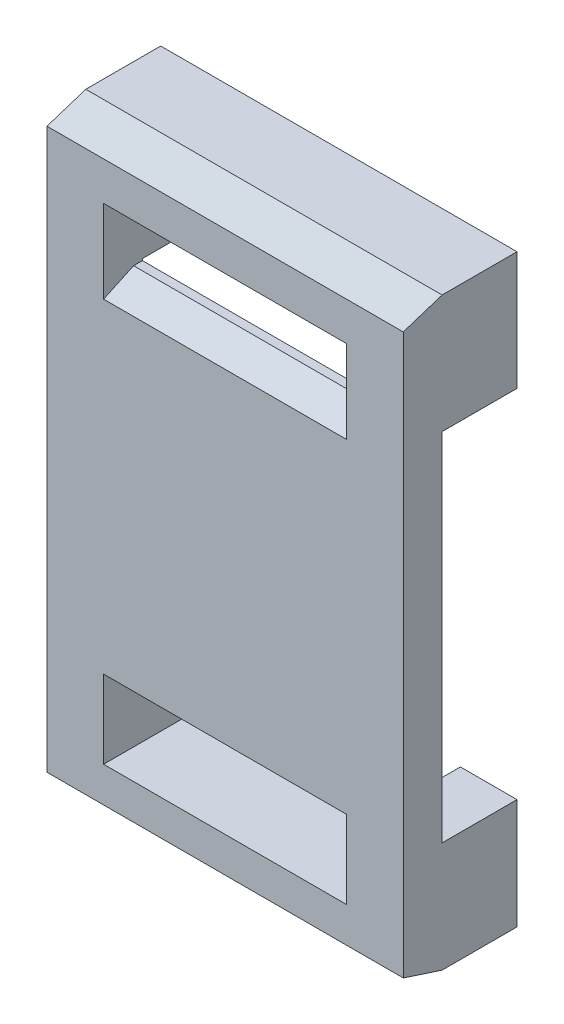
ISO-10303-21;
HEADER;
FILE_DESCRIPTION(('STEP AP214'),'2;1');
FILE_NAME('part.step','',(''),(''),'','','');
FILE_SCHEMA(('AUTOMOTIVE_DESIGN { 1 0 10303 214 1 1 1 1 }'));
ENDSEC;
DATA;
#1=APPLICATION_CONTEXT('core data for automotive mechanical design processes');
#2=APPLICATION_PROTOCOL_DEFINITION('international standard','automotive_design',2000,#1);
#3=PRODUCT_CONTEXT('',#1,'mechanical');
#4=PRODUCT('Part','Part','',(#3));
#5=PRODUCT_RELATED_PRODUCT_CATEGORY('part','',(#4));
#6=PRODUCT_DEFINITION_FORMATION('','',#4);
#7=PRODUCT_DEFINITION_CONTEXT('part definition',#1,'design');
#8=PRODUCT_DEFINITION('design','',#6,#7);
#9=PRODUCT_DEFINITION_SHAPE('','',#8);
#10=(LENGTH_UNIT() NAMED_UNIT(*) SI_UNIT(.MILLI.,.METRE.));
#11=(NAMED_UNIT(*) PLANE_ANGLE_UNIT() SI_UNIT($,.RADIAN.));
#12=(NAMED_UNIT(*) SI_UNIT($,.STERADIAN.) SOLID_ANGLE_UNIT());
#13=UNCERTAINTY_MEASURE_WITH_UNIT(LENGTH_MEASURE(1.E-05),#10,'distance_accuracy_value','');
#14=(GEOMETRIC_REPRESENTATION_CONTEXT(3) GLOBAL_UNCERTAINTY_ASSIGNED_CONTEXT((#13)) GLOBAL_UNIT_ASSIGNED_CONTEXT((#10,
#11,#12)) REPRESENTATION_CONTEXT('',''));
#15=CARTESIAN_POINT('',(0.,0.,0.));
#16=DIRECTION('',(0.,0.,1.));
#17=DIRECTION('',(1.,0.,0.));
#18=AXIS2_PLACEMENT_3D('',#15,#16,#17);
#19=CARTESIAN_POINT('',(43.8188937900036,2.78219181868884,152.2));
#20=DIRECTION('',(0.,0.,-1.));
#21=DIRECTION('',(-1.,0.,0.));
#22=AXIS2_PLACEMENT_3D('',#19,#20,#21);
#23=PLANE('',#22);
#24=DIRECTION('',(1.,0.,0.));
#25=VECTOR('',#24,1.);
#26=CARTESIAN_POINT('',(21.44814873,-17.3178089545572,152.2));
#27=LINE('',#26,#25);
#28=CARTESIAN_POINT('',(7.66270822982748,-17.3178089545572,152.2));
#29=VERTEX_POINT('',#28);
#30=CARTESIAN_POINT('',(21.44814873,-17.3178089545572,152.2));
#31=VERTEX_POINT('',#30);
#32=EDGE_CURVE('E304',#29,#31,#27,.T.);
#33=ORIENTED_EDGE('',*,*,#32,.F.);
#34=DIRECTION('',(0.,1.,0.));
#35=VECTOR('',#34,1.);
#36=CARTESIAN_POINT('',(7.66270822982748,2.78219181868884,152.2));
#37=LINE('',#36,#35);
#38=CARTESIAN_POINT('',(7.66270822982748,-17.4178089545572,152.2));
#39=VERTEX_POINT('',#38);
#40=EDGE_CURVE('E226',#29,#39,#37,.F.);
#41=ORIENTED_EDGE('',*,*,#40,.T.);
#42=DIRECTION('',(1.,0.,0.));
#43=VECTOR('',#42,1.);
#44=CARTESIAN_POINT('',(43.8188937900036,-17.4178089545572,152.2));
#45=LINE('',#44,#43);
#46=CARTESIAN_POINT('',(4.45072794,-17.4178089545573,152.2));
#47=VERTEX_POINT('',#46);
#48=EDGE_CURVE('E308',#47,#39,#45,.T.);
#49=ORIENTED_EDGE('',*,*,#48,.F.);
#50=DIRECTION('',(0.,1.,0.));
#51=VECTOR('',#50,1.);
#52=CARTESIAN_POINT('',(4.45072794,9.49392069,152.2));
#53=LINE('',#52,#51);
#54=CARTESIAN_POINT('',(4.45072794,2.78219181868884,152.2));
#55=VERTEX_POINT('',#54);
#56=EDGE_CURVE('E267',#47,#55,#53,.T.);
#57=ORIENTED_EDGE('',*,*,#56,.T.);
#58=DIRECTION('',(1.,0.,0.));
#59=VECTOR('',#58,1.);
#60=CARTESIAN_POINT('',(43.8188937900036,2.78219181868884,152.2));
#61=LINE('',#60,#59);
#62=CARTESIAN_POINT('',(7.66270822982748,2.78219181868884,152.2));
#63=VERTEX_POINT('',#62);
#64=EDGE_CURVE('E213',#63,#55,#61,.F.);
#65=ORIENTED_EDGE('',*,*,#64,.F.);
#66=DIRECTION('',(0.,1.,0.));
#67=VECTOR('',#66,1.);
#68=CARTESIAN_POINT('',(7.66270822982748,2.78219181868884,152.2));
#69=LINE('',#68,#67);
#70=CARTESIAN_POINT('',(7.66270822982748,2.68219181868884,152.2));
#71=VERTEX_POINT('',#70);
#72=EDGE_CURVE('E35',#63,#71,#69,.F.);
#73=ORIENTED_EDGE('',*,*,#72,.T.);
#74=DIRECTION('',(-1.,0.,0.));
#75=VECTOR('',#74,1.);
#76=CARTESIAN_POINT('',(7.66270822982748,2.68219181868884,152.2));
#77=LINE('',#76,#75);
#78=CARTESIAN_POINT('',(21.44814873,2.68219181868884,152.2));
#79=VERTEX_POINT('',#78);
#80=EDGE_CURVE('E205',#79,#71,#77,.T.);
#81=ORIENTED_EDGE('',*,*,#80,.F.);
#82=DIRECTION('',(0.,1.,0.));
#83=VECTOR('',#82,1.);
#84=CARTESIAN_POINT('',(21.44814873,2.78219181868884,152.2));
#85=LINE('',#84,#83);
#86=CARTESIAN_POINT('',(21.44814873,2.78219181868884,152.2));
#87=VERTEX_POINT('',#86);
#88=EDGE_CURVE('E215',#79,#87,#85,.T.);
#89=ORIENTED_EDGE('',*,*,#88,.T.);
#90=DIRECTION('',(1.,0.,0.));
#91=VECTOR('',#90,1.);
#92=CARTESIAN_POINT('',(43.8188937900036,2.78219181868884,152.2));
#93=LINE('',#92,#91);
#94=CARTESIAN_POINT('',(24.6601387687844,2.78219181868884,152.2));
#95=VERTEX_POINT('',#94);
#96=EDGE_CURVE('E206',#95,#87,#93,.F.);
#97=ORIENTED_EDGE('',*,*,#96,.F.);
#98=DIRECTION('',(0.,-1.,0.));
#99=VECTOR('',#98,1.);
#100=CARTESIAN_POINT('',(24.6601387687844,-23.66975969,152.2));
#101=LINE('',#100,#99);
#102=CARTESIAN_POINT('',(24.6601387687844,-17.4178089545572,152.2));
#103=VERTEX_POINT('',#102);
#104=EDGE_CURVE('E278',#95,#103,#101,.T.);
#105=ORIENTED_EDGE('',*,*,#104,.T.);
#106=DIRECTION('',(1.,0.,0.));
#107=VECTOR('',#106,1.);
#108=CARTESIAN_POINT('',(43.8188937900036,-17.4178089545572,152.2));
#109=LINE('',#108,#107);
#110=CARTESIAN_POINT('',(21.44814873,-17.4178089545572,152.2));
#111=VERTEX_POINT('',#110);
#112=EDGE_CURVE('E301',#111,#103,#109,.T.);
#113=ORIENTED_EDGE('',*,*,#112,.F.);
#114=DIRECTION('',(0.,1.,0.));
#115=VECTOR('',#114,1.);
#116=CARTESIAN_POINT('',(21.44814873,2.78219181868884,152.2));
#117=LINE('',#116,#115);
#118=EDGE_CURVE('E228',#111,#31,#117,.T.);
#119=ORIENTED_EDGE('',*,*,#118,.T.);
#120=EDGE_LOOP('',(#33,#41,#49,#57,#65,#73,#81,#89,#97,#105,#113,#119));
#121=FACE_BOUND('',#120,.T.);
#122=ADVANCED_FACE('F32',(#121),#23,.T.);
#123=CARTESIAN_POINT('',(24.6601387687844,9.49392069,154.4));
#124=DIRECTION('',(0.,-1.,0.));
#125=DIRECTION('',(1.,0.,0.));
#126=AXIS2_PLACEMENT_3D('',#123,#124,#125);
#127=PLANE('',#126);
#128=DIRECTION('',(0.,0.,1.));
#129=VECTOR('',#128,1.);
#130=CARTESIAN_POINT('',(24.6601387687844,9.49392069,154.4));
#131=LINE('',#130,#129);
#132=CARTESIAN_POINT('',(24.6601387687844,9.49392069,152.199999979562));
#133=VERTEX_POINT('',#132);
#134=CARTESIAN_POINT('',(24.6601387687844,9.49392069,147.95));
#135=VERTEX_POINT('',#134);
#136=EDGE_CURVE('E284',#133,#135,#131,.F.);
#137=ORIENTED_EDGE('',*,*,#136,.T.);
#138=DIRECTION('',(1.,0.,0.));
#139=VECTOR('',#138,1.);
#140=CARTESIAN_POINT('',(0.,9.49392069,147.95));
#141=LINE('',#140,#139);
#142=CARTESIAN_POINT('',(4.45072794,9.49392069,147.95));
#143=VERTEX_POINT('',#142);
#144=EDGE_CURVE('E313',#135,#143,#141,.F.);
#145=ORIENTED_EDGE('',*,*,#144,.T.);
#146=DIRECTION('',(0.,0.,-1.));
#147=VECTOR('',#146,1.);
#148=CARTESIAN_POINT('',(4.45072794,9.49392069,154.4));
#149=LINE('',#148,#147);
#150=CARTESIAN_POINT('',(4.45072794,9.49392069,152.199999979563));
#151=VERTEX_POINT('',#150);
#152=EDGE_CURVE('E260',#143,#151,#149,.F.);
#153=ORIENTED_EDGE('',*,*,#152,.T.);
#154=DIRECTION('',(1.,0.,0.));
#155=VECTOR('',#154,1.);
#156=CARTESIAN_POINT('',(43.8188937900036,9.49392069000003,152.199999979562));
#157=LINE('',#156,#155);
#158=EDGE_CURVE('E269',#133,#151,#157,.F.);
#159=ORIENTED_EDGE('',*,*,#158,.F.);
#160=EDGE_LOOP('',(#137,#145,#153,#159));
#161=FACE_BOUND('',#160,.T.);
#162=ADVANCED_FACE('F435',(#161),#127,.F.);
#163=CARTESIAN_POINT('',(4.45072794,-23.66975969,154.4));
#164=DIRECTION('',(0.,1.,0.));
#165=DIRECTION('',(0.,0.,1.));
#166=AXIS2_PLACEMENT_3D('',#163,#164,#165);
#167=PLANE('',#166);
#168=DIRECTION('',(1.,0.,0.));
#169=VECTOR('',#168,1.);
#170=CARTESIAN_POINT('',(43.8188937900036,-23.6697596899999,152.199999979563));
#171=LINE('',#170,#169);
#172=CARTESIAN_POINT('',(24.6601387687844,-23.66975969,152.199999979563));
#173=VERTEX_POINT('',#172);
#174=CARTESIAN_POINT('',(4.45072794,-23.6697596899999,152.199999979563));
#175=VERTEX_POINT('',#174);
#176=EDGE_CURVE('E293',#173,#175,#171,.F.);
#177=ORIENTED_EDGE('',*,*,#176,.T.);
#178=DIRECTION('',(0.,0.,-1.));
#179=VECTOR('',#178,1.);
#180=CARTESIAN_POINT('',(4.45072794,-23.66975969,154.4));
#181=LINE('',#180,#179);
#182=CARTESIAN_POINT('',(4.45072794,-23.66975969,147.95));
#183=VERTEX_POINT('',#182);
#184=EDGE_CURVE('E253',#175,#183,#181,.T.);
#185=ORIENTED_EDGE('',*,*,#184,.T.);
#186=DIRECTION('',(1.,0.,0.));
#187=VECTOR('',#186,1.);
#188=CARTESIAN_POINT('',(0.,-23.66975969,147.95));
#189=LINE('',#188,#187);
#190=CARTESIAN_POINT('',(24.6601387687844,-23.66975969,147.95));
#191=VERTEX_POINT('',#190);
#192=EDGE_CURVE('E297',#183,#191,#189,.T.);
#193=ORIENTED_EDGE('',*,*,#192,.T.);
#194=DIRECTION('',(0.,0.,1.));
#195=VECTOR('',#194,1.);
#196=CARTESIAN_POINT('',(24.6601387687844,-23.66975969,154.4));
#197=LINE('',#196,#195);
#198=EDGE_CURVE('E288',#191,#173,#197,.T.);
#199=ORIENTED_EDGE('',*,*,#198,.T.);
#200=EDGE_LOOP('',(#177,#185,#193,#199));
#201=FACE_BOUND('',#200,.T.);
#202=ADVANCED_FACE('F449',(#201),#167,.F.);
#203=CARTESIAN_POINT('',(43.8188937900036,2.78219181868884,120.8));
#204=DIRECTION('',(0.,-1.,0.));
#205=DIRECTION('',(0.,0.,-1.));
#206=AXIS2_PLACEMENT_3D('',#203,#204,#205);
#207=PLANE('',#206);
#208=ORIENTED_EDGE('',*,*,#96,.T.);
#209=DIRECTION('',(0.,0.,1.));
#210=VECTOR('',#209,1.);
#211=CARTESIAN_POINT('',(21.44814873,2.78219181868884,154.4));
#212=LINE('',#211,#210);
#213=CARTESIAN_POINT('',(21.44814873,2.78219181868884,147.95));
#214=VERTEX_POINT('',#213);
#215=EDGE_CURVE('E234',#214,#87,#212,.T.);
#216=ORIENTED_EDGE('',*,*,#215,.F.);
#217=DIRECTION('',(1.,0.,0.));
#218=VECTOR('',#217,1.);
#219=CARTESIAN_POINT('',(0.,2.78219181868884,147.95));
#220=LINE('',#219,#218);
#221=CARTESIAN_POINT('',(24.6601387687844,2.78219181868884,147.95));
#222=VERTEX_POINT('',#221);
#223=EDGE_CURVE('E220',#214,#222,#220,.T.);
#224=ORIENTED_EDGE('',*,*,#223,.T.);
#225=DIRECTION('',(0.,0.,1.));
#226=VECTOR('',#225,1.);
#227=CARTESIAN_POINT('',(24.6601387687844,2.78219181868884,154.4));
#228=LINE('',#227,#226);
#229=EDGE_CURVE('E237',#222,#95,#228,.T.);
#230=ORIENTED_EDGE('',*,*,#229,.T.);
#231=EDGE_LOOP('',(#208,#216,#224,#230));
#232=FACE_BOUND('',#231,.T.);
#233=ADVANCED_FACE('F233',(#232),#207,.T.);
#234=CARTESIAN_POINT('',(7.66270822982748,2.68219181868884,154.4));
#235=DIRECTION('',(0.,1.,0.));
#236=DIRECTION('',(-1.,0.,0.));
#237=AXIS2_PLACEMENT_3D('',#234,#235,#236);
#238=PLANE('',#237);
#239=DIRECTION('',(0.,0.,1.));
#240=VECTOR('',#239,1.);
#241=CARTESIAN_POINT('',(21.44814873,2.68219181868884,154.4));
#242=LINE('',#241,#240);
#243=CARTESIAN_POINT('',(21.44814873,2.68219181868884,152.7));
#244=VERTEX_POINT('',#243);
#245=EDGE_CURVE('E218',#79,#244,#242,.T.);
#246=ORIENTED_EDGE('',*,*,#245,.F.);
#247=ORIENTED_EDGE('',*,*,#80,.T.);
#248=DIRECTION('',(0.,0.,1.));
#249=VECTOR('',#248,1.);
#250=CARTESIAN_POINT('',(7.66270822982748,2.68219181868884,154.4));
#251=LINE('',#250,#249);
#252=CARTESIAN_POINT('',(7.66270822982748,2.68219181868884,152.7));
#253=VERTEX_POINT('',#252);
#254=EDGE_CURVE('E194',#71,#253,#251,.T.);
#255=ORIENTED_EDGE('',*,*,#254,.T.);
#256=DIRECTION('',(1.,0.,0.));
#257=VECTOR('',#256,1.);
#258=CARTESIAN_POINT('',(7.66270822982748,2.68219181868884,152.7));
#259=LINE('',#258,#257);
#260=EDGE_CURVE('E367',#253,#244,#259,.T.);
#261=ORIENTED_EDGE('',*,*,#260,.T.);
#262=EDGE_LOOP('',(#246,#247,#255,#261));
#263=FACE_BOUND('',#262,.T.);
#264=ADVANCED_FACE('F216',(#263),#238,.T.);
#265=CARTESIAN_POINT('',(43.8188937900036,2.78219181868884,120.8));
#266=DIRECTION('',(0.,-1.,0.));
#267=DIRECTION('',(0.,0.,-1.));
#268=AXIS2_PLACEMENT_3D('',#265,#266,#267);
#269=PLANE('',#268);
#270=DIRECTION('',(1.,0.,0.));
#271=VECTOR('',#270,1.);
#272=CARTESIAN_POINT('',(0.,2.78219181868884,147.95));
#273=LINE('',#272,#271);
#274=CARTESIAN_POINT('',(4.45072794,2.78219181868884,147.95));
#275=VERTEX_POINT('',#274);
#276=CARTESIAN_POINT('',(7.66270822982748,2.78219181868884,147.95));
#277=VERTEX_POINT('',#276);
#278=EDGE_CURVE('E311',#275,#277,#273,.T.);
#279=ORIENTED_EDGE('',*,*,#278,.T.);
#280=DIRECTION('',(0.,0.,-1.));
#281=VECTOR('',#280,1.);
#282=CARTESIAN_POINT('',(7.66270822982748,2.78219181868884,154.4));
#283=LINE('',#282,#281);
#284=EDGE_CURVE('E362',#63,#277,#283,.T.);
#285=ORIENTED_EDGE('',*,*,#284,.F.);
#286=ORIENTED_EDGE('',*,*,#64,.T.);
#287=DIRECTION('',(0.,0.,-1.));
#288=VECTOR('',#287,1.);
#289=CARTESIAN_POINT('',(4.45072794,2.78219181868884,154.4));
#290=LINE('',#289,#288);
#291=EDGE_CURVE('E265',#55,#275,#290,.T.);
#292=ORIENTED_EDGE('',*,*,#291,.T.);
#293=EDGE_LOOP('',(#279,#285,#286,#292));
#294=FACE_BOUND('',#293,.T.);
#295=ADVANCED_FACE('F423',(#294),#269,.T.);
#296=CARTESIAN_POINT('',(0.,0.,147.95));
#297=DIRECTION('',(0.,0.,1.));
#298=DIRECTION('',(1.,0.,0.));
#299=AXIS2_PLACEMENT_3D('',#296,#297,#298);
#300=PLANE('',#299);
#301=DIRECTION('',(0.,1.,0.));
#302=VECTOR('',#301,1.);
#303=CARTESIAN_POINT('',(4.45072794,9.49392069,147.95));
#304=LINE('',#303,#302);
#305=EDGE_CURVE('E262',#275,#143,#304,.T.);
#306=ORIENTED_EDGE('',*,*,#305,.T.);
#307=ORIENTED_EDGE('',*,*,#144,.F.);
#308=DIRECTION('',(0.,-1.,0.));
#309=VECTOR('',#308,1.);
#310=CARTESIAN_POINT('',(24.6601387687844,-23.66975969,147.95));
#311=LINE('',#310,#309);
#312=EDGE_CURVE('E281',#135,#222,#311,.T.);
#313=ORIENTED_EDGE('',*,*,#312,.T.);
#314=ORIENTED_EDGE('',*,*,#223,.F.);
#315=DIRECTION('',(0.,1.,0.));
#316=VECTOR('',#315,1.);
#317=CARTESIAN_POINT('',(21.44814873,2.68219181868884,147.95));
#318=LINE('',#317,#316);
#319=CARTESIAN_POINT('',(21.44814873,6.59502381,147.95));
#320=VERTEX_POINT('',#319);
#321=EDGE_CURVE('E242',#320,#214,#318,.F.);
#322=ORIENTED_EDGE('',*,*,#321,.F.);
#323=DIRECTION('',(1.,0.,0.));
#324=VECTOR('',#323,1.);
#325=CARTESIAN_POINT('',(21.44814873,6.59502381,147.95));
#326=LINE('',#325,#324);
#327=CARTESIAN_POINT('',(7.66270822982748,6.59502381,147.95));
#328=VERTEX_POINT('',#327);
#329=EDGE_CURVE('E357',#328,#320,#326,.T.);
#330=ORIENTED_EDGE('',*,*,#329,.F.);
#331=DIRECTION('',(0.,1.,0.));
#332=VECTOR('',#331,1.);
#333=CARTESIAN_POINT('',(7.66270822982748,6.59502381,147.95));
#334=LINE('',#333,#332);
#335=EDGE_CURVE('E360',#277,#328,#334,.T.);
#336=ORIENTED_EDGE('',*,*,#335,.F.);
#337=ORIENTED_EDGE('',*,*,#278,.F.);
#338=EDGE_LOOP('',(#306,#307,#313,#314,#322,#330,#336,#337));
#339=FACE_BOUND('',#338,.T.);
#340=ADVANCED_FACE('F317',(#339),#300,.F.);
#341=CARTESIAN_POINT('',(43.8188937900036,-17.4178089545572,152.2));
#342=DIRECTION('',(0.,1.,0.));
#343=DIRECTION('',(0.,0.,1.));
#344=AXIS2_PLACEMENT_3D('',#341,#342,#343);
#345=PLANE('',#344);
#346=ORIENTED_EDGE('',*,*,#48,.T.);
#347=DIRECTION('',(0.,0.,1.));
#348=VECTOR('',#347,1.);
#349=CARTESIAN_POINT('',(7.66270822982748,-17.4178089545572,154.4));
#350=LINE('',#349,#348);
#351=CARTESIAN_POINT('',(7.66270822982748,-17.4178089545572,147.95));
#352=VERTEX_POINT('',#351);
#353=EDGE_CURVE('E349',#39,#352,#350,.F.);
#354=ORIENTED_EDGE('',*,*,#353,.T.);
#355=DIRECTION('',(1.,0.,0.));
#356=VECTOR('',#355,1.);
#357=CARTESIAN_POINT('',(0.,-17.4178089545572,147.95));
#358=LINE('',#357,#356);
#359=CARTESIAN_POINT('',(4.45072794,-17.4178089545573,147.95));
#360=VERTEX_POINT('',#359);
#361=EDGE_CURVE('E299',#352,#360,#358,.F.);
#362=ORIENTED_EDGE('',*,*,#361,.T.);
#363=DIRECTION('',(0.,0.,-1.));
#364=VECTOR('',#363,1.);
#365=CARTESIAN_POINT('',(4.45072794,-17.4178089545573,154.4));
#366=LINE('',#365,#364);
#367=EDGE_CURVE('E243',#360,#47,#366,.F.);
#368=ORIENTED_EDGE('',*,*,#367,.T.);
#369=EDGE_LOOP('',(#346,#354,#362,#368));
#370=FACE_BOUND('',#369,.T.);
#371=ADVANCED_FACE('F583',(#370),#345,.T.);
#372=CARTESIAN_POINT('',(21.44814873,-17.3178089545572,154.4));
#373=DIRECTION('',(0.,-1.,0.));
#374=DIRECTION('',(0.,0.,-1.));
#375=AXIS2_PLACEMENT_3D('',#372,#373,#374);
#376=PLANE('',#375);
#377=DIRECTION('',(0.,0.,1.));
#378=VECTOR('',#377,1.);
#379=CARTESIAN_POINT('',(7.66270822982748,-17.3178089545572,154.4));
#380=LINE('',#379,#378);
#381=CARTESIAN_POINT('',(7.66270822982748,-17.3178089545572,152.7));
#382=VERTEX_POINT('',#381);
#383=EDGE_CURVE('E344',#382,#29,#380,.F.);
#384=ORIENTED_EDGE('',*,*,#383,.T.);
#385=ORIENTED_EDGE('',*,*,#32,.T.);
#386=DIRECTION('',(0.,0.,-1.));
#387=VECTOR('',#386,1.);
#388=CARTESIAN_POINT('',(21.44814873,-17.3178089545572,154.4));
#389=LINE('',#388,#387);
#390=CARTESIAN_POINT('',(21.44814873,-17.3178089545572,152.7));
#391=VERTEX_POINT('',#390);
#392=EDGE_CURVE('E189',#31,#391,#389,.F.);
#393=ORIENTED_EDGE('',*,*,#392,.T.);
#394=DIRECTION('',(1.,0.,0.));
#395=VECTOR('',#394,1.);
#396=CARTESIAN_POINT('',(21.44814873,-17.3178089545572,152.7));
#397=LINE('',#396,#395);
#398=EDGE_CURVE('E342',#391,#382,#397,.F.);
#399=ORIENTED_EDGE('',*,*,#398,.T.);
#400=EDGE_LOOP('',(#384,#385,#393,#399));
#401=FACE_BOUND('',#400,.T.);
#402=ADVANCED_FACE('F574',(#401),#376,.T.);
#403=CARTESIAN_POINT('',(43.8188937900036,-17.4178089545572,152.2));
#404=DIRECTION('',(0.,1.,0.));
#405=DIRECTION('',(0.,0.,1.));
#406=AXIS2_PLACEMENT_3D('',#403,#404,#405);
#407=PLANE('',#406);
#408=DIRECTION('',(1.,0.,0.));
#409=VECTOR('',#408,1.);
#410=CARTESIAN_POINT('',(0.,-17.4178089545572,147.95));
#411=LINE('',#410,#409);
#412=CARTESIAN_POINT('',(24.6601387687844,-17.4178089545572,147.95));
#413=VERTEX_POINT('',#412);
#414=CARTESIAN_POINT('',(21.44814873,-17.4178089545572,147.95));
#415=VERTEX_POINT('',#414);
#416=EDGE_CURVE('E295',#413,#415,#411,.F.);
#417=ORIENTED_EDGE('',*,*,#416,.T.);
#418=DIRECTION('',(0.,0.,-1.));
#419=VECTOR('',#418,1.);
#420=CARTESIAN_POINT('',(21.44814873,-17.4178089545572,154.4));
#421=LINE('',#420,#419);
#422=EDGE_CURVE('E327',#415,#111,#421,.F.);
#423=ORIENTED_EDGE('',*,*,#422,.T.);
#424=ORIENTED_EDGE('',*,*,#112,.T.);
#425=DIRECTION('',(0.,0.,1.));
#426=VECTOR('',#425,1.);
#427=CARTESIAN_POINT('',(24.6601387687844,-17.4178089545572,154.4));
#428=LINE('',#427,#426);
#429=EDGE_CURVE('E275',#103,#413,#428,.F.);
#430=ORIENTED_EDGE('',*,*,#429,.T.);
#431=EDGE_LOOP('',(#417,#423,#424,#430));
#432=FACE_BOUND('',#431,.T.);
#433=ADVANCED_FACE('F325',(#432),#407,.T.);
#434=CARTESIAN_POINT('',(0.,0.,147.95));
#435=DIRECTION('',(0.,0.,1.));
#436=DIRECTION('',(1.,0.,0.));
#437=AXIS2_PLACEMENT_3D('',#434,#435,#436);
#438=PLANE('',#437);
#439=DIRECTION('',(0.,-1.,0.));
#440=VECTOR('',#439,1.);
#441=CARTESIAN_POINT('',(24.6601387687844,-23.66975969,147.95));
#442=LINE('',#441,#440);
#443=EDGE_CURVE('E290',#413,#191,#442,.T.);
#444=ORIENTED_EDGE('',*,*,#443,.T.);
#445=ORIENTED_EDGE('',*,*,#192,.F.);
#446=DIRECTION('',(0.,1.,0.));
#447=VECTOR('',#446,1.);
#448=CARTESIAN_POINT('',(4.45072794,9.49392069,147.95));
#449=LINE('',#448,#447);
#450=EDGE_CURVE('E247',#183,#360,#449,.T.);
#451=ORIENTED_EDGE('',*,*,#450,.T.);
#452=ORIENTED_EDGE('',*,*,#361,.F.);
#453=DIRECTION('',(0.,1.,0.));
#454=VECTOR('',#453,1.);
#455=CARTESIAN_POINT('',(7.66270822982748,-20.95417578,147.95));
#456=LINE('',#455,#454);
#457=CARTESIAN_POINT('',(7.66270822982748,-20.95417578,147.95));
#458=VERTEX_POINT('',#457);
#459=EDGE_CURVE('E347',#352,#458,#456,.F.);
#460=ORIENTED_EDGE('',*,*,#459,.T.);
#461=DIRECTION('',(1.,0.,0.));
#462=VECTOR('',#461,1.);
#463=CARTESIAN_POINT('',(7.66270822982748,-20.95417578,147.95));
#464=LINE('',#463,#462);
#465=CARTESIAN_POINT('',(21.44814873,-20.95417578,147.95));
#466=VERTEX_POINT('',#465);
#467=EDGE_CURVE('E329',#466,#458,#464,.F.);
#468=ORIENTED_EDGE('',*,*,#467,.F.);
#469=DIRECTION('',(0.,1.,0.));
#470=VECTOR('',#469,1.);
#471=CARTESIAN_POINT('',(21.44814873,-17.3178089545572,147.95));
#472=LINE('',#471,#470);
#473=EDGE_CURVE('E330',#466,#415,#472,.T.);
#474=ORIENTED_EDGE('',*,*,#473,.T.);
#475=ORIENTED_EDGE('',*,*,#416,.F.);
#476=EDGE_LOOP('',(#444,#445,#451,#452,#460,#468,#474,#475));
#477=FACE_BOUND('',#476,.T.);
#478=ADVANCED_FACE('F451',(#477),#438,.F.);
#479=CARTESIAN_POINT('',(43.8188937900036,-22.2915599326799,156.439426869126));
#480=DIRECTION('',(0.,0.951008611238393,-0.309164392112712));
#481=DIRECTION('',(0.,0.309164392112712,0.951008611238393));
#482=AXIS2_PLACEMENT_3D('',#479,#480,#481);
#483=PLANE('',#482);
#484=DIRECTION('',(0.,-0.309164392112739,-0.951008611238384));
#485=VECTOR('',#484,1.);
#486=CARTESIAN_POINT('',(4.45072794,-22.9545593638108,154.4));
#487=LINE('',#486,#485);
#488=CARTESIAN_POINT('',(4.45072794,-22.9545593638108,154.4));
#489=VERTEX_POINT('',#488);
#490=EDGE_CURVE('E255',#489,#175,#487,.T.);
#491=ORIENTED_EDGE('',*,*,#490,.T.);
#492=ORIENTED_EDGE('',*,*,#176,.F.);
#493=DIRECTION('',(0.,0.30916439211274,0.951008611238384));
#494=VECTOR('',#493,1.);
#495=CARTESIAN_POINT('',(24.6601387687844,-23.66975969,152.199999979563));
#496=LINE('',#495,#494);
#497=CARTESIAN_POINT('',(24.6601387687844,-22.9545593638108,154.4));
#498=VERTEX_POINT('',#497);
#499=EDGE_CURVE('E286',#173,#498,#496,.T.);
#500=ORIENTED_EDGE('',*,*,#499,.T.);
#501=DIRECTION('',(1.,0.,0.));
#502=VECTOR('',#501,1.);
#503=CARTESIAN_POINT('',(0.,-22.9545593638108,154.4));
#504=LINE('',#503,#502);
#505=EDGE_CURVE('E397',#489,#498,#504,.T.);
#506=ORIENTED_EDGE('',*,*,#505,.F.);
#507=EDGE_LOOP('',(#491,#492,#500,#506));
#508=FACE_BOUND('',#507,.T.);
#509=ADVANCED_FACE('F444',(#508),#483,.F.);
#510=CARTESIAN_POINT('',(24.6601387687844,-23.66975969,154.4));
#511=DIRECTION('',(-1.,0.,0.));
#512=DIRECTION('',(0.,-1.,0.));
#513=AXIS2_PLACEMENT_3D('',#510,#511,#512);
#514=PLANE('',#513);
#515=ORIENTED_EDGE('',*,*,#104,.F.);
#516=ORIENTED_EDGE('',*,*,#229,.F.);
#517=ORIENTED_EDGE('',*,*,#312,.F.);
#518=ORIENTED_EDGE('',*,*,#136,.F.);
#519=DIRECTION('',(0.,-0.309164392112712,0.951008611238393));
#520=VECTOR('',#519,1.);
#521=CARTESIAN_POINT('',(24.6601387687844,8.11572093267996,156.439426869126));
#522=LINE('',#521,#520);
#523=CARTESIAN_POINT('',(24.6601387687844,8.77872036381078,154.4));
#524=VERTEX_POINT('',#523);
#525=EDGE_CURVE('E272',#524,#133,#522,.F.);
#526=ORIENTED_EDGE('',*,*,#525,.F.);
#527=DIRECTION('',(0.,1.,0.));
#528=VECTOR('',#527,1.);
#529=CARTESIAN_POINT('',(24.6601387687844,0.,154.4));
#530=LINE('',#529,#528);
#531=EDGE_CURVE('E394',#498,#524,#530,.T.);
#532=ORIENTED_EDGE('',*,*,#531,.F.);
#533=ORIENTED_EDGE('',*,*,#499,.F.);
#534=ORIENTED_EDGE('',*,*,#198,.F.);
#535=ORIENTED_EDGE('',*,*,#443,.F.);
#536=ORIENTED_EDGE('',*,*,#429,.F.);
#537=EDGE_LOOP('',(#515,#516,#517,#518,#526,#532,#533,#534,#535,#536));
#538=FACE_BOUND('',#537,.T.);
#539=ADVANCED_FACE('F319',(#538),#514,.F.);
#540=CARTESIAN_POINT('',(43.8188937900036,8.11572093267996,156.439426869126));
#541=DIRECTION('',(0.,0.951008611238393,0.309164392112712));
#542=DIRECTION('',(0.,-0.309164392112712,0.951008611238393));
#543=AXIS2_PLACEMENT_3D('',#540,#541,#542);
#544=PLANE('',#543);
#545=DIRECTION('',(0.,-0.309164392112745,0.951008611238382));
#546=VECTOR('',#545,1.);
#547=CARTESIAN_POINT('',(4.45072794,9.49392069,152.199999979563));
#548=LINE('',#547,#546);
#549=CARTESIAN_POINT('',(4.45072794,8.77872036381077,154.4));
#550=VERTEX_POINT('',#549);
#551=EDGE_CURVE('E258',#151,#550,#548,.T.);
#552=ORIENTED_EDGE('',*,*,#551,.T.);
#553=DIRECTION('',(1.,0.,0.));
#554=VECTOR('',#553,1.);
#555=CARTESIAN_POINT('',(0.,8.77872036381079,154.4));
#556=LINE('',#555,#554);
#557=EDGE_CURVE('E388',#524,#550,#556,.F.);
#558=ORIENTED_EDGE('',*,*,#557,.F.);
#559=ORIENTED_EDGE('',*,*,#525,.T.);
#560=ORIENTED_EDGE('',*,*,#158,.T.);
#561=EDGE_LOOP('',(#552,#558,#559,#560));
#562=FACE_BOUND('',#561,.T.);
#563=ADVANCED_FACE('F437',(#562),#544,.T.);
#564=CARTESIAN_POINT('',(4.45072794,9.49392069,154.4));
#565=DIRECTION('',(1.,0.,0.));
#566=DIRECTION('',(0.,0.,-1.));
#567=AXIS2_PLACEMENT_3D('',#564,#565,#566);
#568=PLANE('',#567);
#569=ORIENTED_EDGE('',*,*,#450,.F.);
#570=ORIENTED_EDGE('',*,*,#184,.F.);
#571=ORIENTED_EDGE('',*,*,#490,.F.);
#572=DIRECTION('',(0.,1.,0.));
#573=VECTOR('',#572,1.);
#574=CARTESIAN_POINT('',(4.45072794,0.,154.4));
#575=LINE('',#574,#573);
#576=EDGE_CURVE('E385',#550,#489,#575,.F.);
#577=ORIENTED_EDGE('',*,*,#576,.F.);
#578=ORIENTED_EDGE('',*,*,#551,.F.);
#579=ORIENTED_EDGE('',*,*,#152,.F.);
#580=ORIENTED_EDGE('',*,*,#305,.F.);
#581=ORIENTED_EDGE('',*,*,#291,.F.);
#582=ORIENTED_EDGE('',*,*,#56,.F.);
#583=ORIENTED_EDGE('',*,*,#367,.F.);
#584=EDGE_LOOP('',(#569,#570,#571,#577,#578,#579,#580,#581,#582,#583));
#585=FACE_BOUND('',#584,.T.);
#586=ADVANCED_FACE('F428',(#585),#568,.F.);
#587=CARTESIAN_POINT('',(21.44814873,2.68219181868884,154.4));
#588=DIRECTION('',(-1.,0.,0.));
#589=DIRECTION('',(0.,0.,1.));
#590=AXIS2_PLACEMENT_3D('',#587,#588,#589);
#591=PLANE('',#590);
#592=DIRECTION('',(0.,0.,1.));
#593=VECTOR('',#592,1.);
#594=CARTESIAN_POINT('',(21.44814873,6.59502381,154.4));
#595=LINE('',#594,#593);
#596=CARTESIAN_POINT('',(21.44814873,6.59502381,154.4));
#597=VERTEX_POINT('',#596);
#598=EDGE_CURVE('E354',#320,#597,#595,.T.);
#599=ORIENTED_EDGE('',*,*,#598,.F.);
#600=ORIENTED_EDGE('',*,*,#321,.T.);
#601=ORIENTED_EDGE('',*,*,#215,.T.);
#602=ORIENTED_EDGE('',*,*,#88,.F.);
#603=ORIENTED_EDGE('',*,*,#245,.T.);
#604=DIRECTION('',(0.,0.422618261740698,-0.906307787036651));
#605=VECTOR('',#604,1.);
#606=CARTESIAN_POINT('',(21.44814873,2.68219181868884,152.7));
#607=LINE('',#606,#605);
#608=CARTESIAN_POINT('',(21.44814873,1.88946879982534,154.4));
#609=VERTEX_POINT('',#608);
#610=EDGE_CURVE('E365',#244,#609,#607,.F.);
#611=ORIENTED_EDGE('',*,*,#610,.T.);
#612=DIRECTION('',(0.,1.,0.));
#613=VECTOR('',#612,1.);
#614=CARTESIAN_POINT('',(21.44814873,0.,154.4));
#615=LINE('',#614,#613);
#616=EDGE_CURVE('E378',#597,#609,#615,.F.);
#617=ORIENTED_EDGE('',*,*,#616,.F.);
#618=EDGE_LOOP('',(#599,#600,#601,#602,#603,#611,#617));
#619=FACE_BOUND('',#618,.T.);
#620=ADVANCED_FACE('F241',(#619),#591,.T.);
#621=CARTESIAN_POINT('',(7.66270822982748,2.68219181868884,152.7));
#622=DIRECTION('',(0.,-0.906307787036651,-0.422618261740698));
#623=DIRECTION('',(0.,0.422618261740698,-0.906307787036651));
#624=AXIS2_PLACEMENT_3D('',#621,#622,#623);
#625=PLANE('',#624);
#626=DIRECTION('',(1.,0.,0.));
#627=VECTOR('',#626,1.);
#628=CARTESIAN_POINT('',(0.,1.88946879982535,154.4));
#629=LINE('',#628,#627);
#630=CARTESIAN_POINT('',(7.66270822982748,1.88946879982534,154.4));
#631=VERTEX_POINT('',#630);
#632=EDGE_CURVE('E373',#609,#631,#629,.F.);
#633=ORIENTED_EDGE('',*,*,#632,.F.);
#634=ORIENTED_EDGE('',*,*,#610,.F.);
#635=ORIENTED_EDGE('',*,*,#260,.F.);
#636=DIRECTION('',(0.,0.422618261740699,-0.90630778703665));
#637=VECTOR('',#636,1.);
#638=CARTESIAN_POINT('',(7.66270822982748,1.88946879982534,154.4));
#639=LINE('',#638,#637);
#640=EDGE_CURVE('E201',#631,#253,#639,.T.);
#641=ORIENTED_EDGE('',*,*,#640,.F.);
#642=EDGE_LOOP('',(#633,#634,#635,#641));
#643=FACE_BOUND('',#642,.T.);
#644=ADVANCED_FACE('F371',(#643),#625,.F.);
#645=CARTESIAN_POINT('',(7.66270822982748,6.59502381,154.4));
#646=DIRECTION('',(1.,0.,0.));
#647=DIRECTION('',(0.,0.,-1.));
#648=AXIS2_PLACEMENT_3D('',#645,#646,#647);
#649=PLANE('',#648);
#650=ORIENTED_EDGE('',*,*,#335,.T.);
#651=DIRECTION('',(0.,0.,1.));
#652=VECTOR('',#651,1.);
#653=CARTESIAN_POINT('',(7.66270822982748,6.59502381,154.4));
#654=LINE('',#653,#652);
#655=CARTESIAN_POINT('',(7.66270822982748,6.59502381,154.4));
#656=VERTEX_POINT('',#655);
#657=EDGE_CURVE('E351',#656,#328,#654,.F.);
#658=ORIENTED_EDGE('',*,*,#657,.F.);
#659=DIRECTION('',(0.,1.,0.));
#660=VECTOR('',#659,1.);
#661=CARTESIAN_POINT('',(7.66270822982748,0.,154.4));
#662=LINE('',#661,#660);
#663=EDGE_CURVE('E377',#631,#656,#662,.T.);
#664=ORIENTED_EDGE('',*,*,#663,.F.);
#665=ORIENTED_EDGE('',*,*,#640,.T.);
#666=ORIENTED_EDGE('',*,*,#254,.F.);
#667=ORIENTED_EDGE('',*,*,#72,.F.);
#668=ORIENTED_EDGE('',*,*,#284,.T.);
#669=EDGE_LOOP('',(#650,#658,#664,#665,#666,#667,#668));
#670=FACE_BOUND('',#669,.T.);
#671=ADVANCED_FACE('F197',(#670),#649,.T.);
#672=CARTESIAN_POINT('',(21.44814873,6.59502381,154.4));
#673=DIRECTION('',(0.,-1.,0.));
#674=DIRECTION('',(1.,0.,0.));
#675=AXIS2_PLACEMENT_3D('',#672,#673,#674);
#676=PLANE('',#675);
#677=DIRECTION('',(1.,0.,0.));
#678=VECTOR('',#677,1.);
#679=CARTESIAN_POINT('',(0.,6.59502381,154.4));
#680=LINE('',#679,#678);
#681=EDGE_CURVE('E384',#656,#597,#680,.T.);
#682=ORIENTED_EDGE('',*,*,#681,.F.);
#683=ORIENTED_EDGE('',*,*,#657,.T.);
#684=ORIENTED_EDGE('',*,*,#329,.T.);
#685=ORIENTED_EDGE('',*,*,#598,.T.);
#686=EDGE_LOOP('',(#682,#683,#684,#685));
#687=FACE_BOUND('',#686,.T.);
#688=ADVANCED_FACE('F419',(#687),#676,.T.);
#689=CARTESIAN_POINT('',(7.66270822982748,-20.95417578,154.4));
#690=DIRECTION('',(-1.,0.,0.));
#691=DIRECTION('',(0.,0.,1.));
#692=AXIS2_PLACEMENT_3D('',#689,#690,#691);
#693=PLANE('',#692);
#694=ORIENTED_EDGE('',*,*,#383,.F.);
#695=DIRECTION('',(0.,0.422618261740697,0.906307787036651));
#696=VECTOR('',#695,1.);
#697=CARTESIAN_POINT('',(7.66270822982748,-17.3178089545572,152.7));
#698=LINE('',#697,#696);
#699=CARTESIAN_POINT('',(7.66270822982748,-16.5250859356937,154.4));
#700=VERTEX_POINT('',#699);
#701=EDGE_CURVE('E340',#382,#700,#698,.T.);
#702=ORIENTED_EDGE('',*,*,#701,.T.);
#703=DIRECTION('',(0.,1.,0.));
#704=VECTOR('',#703,1.);
#705=CARTESIAN_POINT('',(7.66270822982748,0.,154.4));
#706=LINE('',#705,#704);
#707=CARTESIAN_POINT('',(7.66270822982748,-20.95417578,154.4));
#708=VERTEX_POINT('',#707);
#709=EDGE_CURVE('E410',#708,#700,#706,.T.);
#710=ORIENTED_EDGE('',*,*,#709,.F.);
#711=DIRECTION('',(0.,0.,1.));
#712=VECTOR('',#711,1.);
#713=CARTESIAN_POINT('',(7.66270822982748,-20.95417578,154.4));
#714=LINE('',#713,#712);
#715=EDGE_CURVE('E333',#458,#708,#714,.T.);
#716=ORIENTED_EDGE('',*,*,#715,.F.);
#717=ORIENTED_EDGE('',*,*,#459,.F.);
#718=ORIENTED_EDGE('',*,*,#353,.F.);
#719=ORIENTED_EDGE('',*,*,#40,.F.);
#720=EDGE_LOOP('',(#694,#702,#710,#716,#717,#718,#719));
#721=FACE_BOUND('',#720,.T.);
#722=ADVANCED_FACE('F462',(#721),#693,.F.);
#723=CARTESIAN_POINT('',(21.44814873,-17.3178089545572,152.7));
#724=DIRECTION('',(0.,0.906307787036651,-0.422618261740697));
#725=DIRECTION('',(0.,0.422618261740697,0.906307787036651));
#726=AXIS2_PLACEMENT_3D('',#723,#724,#725);
#727=PLANE('',#726);
#728=DIRECTION('',(1.,0.,0.));
#729=VECTOR('',#728,1.);
#730=CARTESIAN_POINT('',(0.,-16.5250859356937,154.4));
#731=LINE('',#730,#729);
#732=CARTESIAN_POINT('',(21.44814873,-16.5250859356937,154.4));
#733=VERTEX_POINT('',#732);
#734=EDGE_CURVE('E412',#700,#733,#731,.T.);
#735=ORIENTED_EDGE('',*,*,#734,.F.);
#736=ORIENTED_EDGE('',*,*,#701,.F.);
#737=ORIENTED_EDGE('',*,*,#398,.F.);
#738=DIRECTION('',(0.,0.422618261740676,0.906307787036661));
#739=VECTOR('',#738,1.);
#740=CARTESIAN_POINT('',(21.44814873,-17.3178089545572,152.7));
#741=LINE('',#740,#739);
#742=EDGE_CURVE('E335',#391,#733,#741,.T.);
#743=ORIENTED_EDGE('',*,*,#742,.T.);
#744=EDGE_LOOP('',(#735,#736,#737,#743));
#745=FACE_BOUND('',#744,.T.);
#746=ADVANCED_FACE('F455',(#745),#727,.F.);
#747=CARTESIAN_POINT('',(21.44814873,-17.3178089545572,154.4));
#748=DIRECTION('',(1.,0.,0.));
#749=DIRECTION('',(0.,0.,-1.));
#750=AXIS2_PLACEMENT_3D('',#747,#748,#749);
#751=PLANE('',#750);
#752=ORIENTED_EDGE('',*,*,#422,.F.);
#753=ORIENTED_EDGE('',*,*,#473,.F.);
#754=DIRECTION('',(0.,0.,1.));
#755=VECTOR('',#754,1.);
#756=CARTESIAN_POINT('',(21.44814873,-20.95417578,154.4));
#757=LINE('',#756,#755);
#758=CARTESIAN_POINT('',(21.44814873,-20.95417578,154.4));
#759=VERTEX_POINT('',#758);
#760=EDGE_CURVE('E50',#759,#466,#757,.F.);
#761=ORIENTED_EDGE('',*,*,#760,.F.);
#762=DIRECTION('',(0.,1.,0.));
#763=VECTOR('',#762,1.);
#764=CARTESIAN_POINT('',(21.44814873,0.,154.4));
#765=LINE('',#764,#763);
#766=EDGE_CURVE('E41',#733,#759,#765,.F.);
#767=ORIENTED_EDGE('',*,*,#766,.F.);
#768=ORIENTED_EDGE('',*,*,#742,.F.);
#769=ORIENTED_EDGE('',*,*,#392,.F.);
#770=ORIENTED_EDGE('',*,*,#118,.F.);
#771=EDGE_LOOP('',(#752,#753,#761,#767,#768,#769,#770));
#772=FACE_BOUND('',#771,.T.);
#773=ADVANCED_FACE('F453',(#772),#751,.F.);
#774=CARTESIAN_POINT('',(7.66270822982748,-20.95417578,154.4));
#775=DIRECTION('',(0.,1.,0.));
#776=DIRECTION('',(0.,0.,1.));
#777=AXIS2_PLACEMENT_3D('',#774,#775,#776);
#778=PLANE('',#777);
#779=DIRECTION('',(1.,0.,0.));
#780=VECTOR('',#779,1.);
#781=CARTESIAN_POINT('',(0.,-20.95417578,154.4));
#782=LINE('',#781,#780);
#783=EDGE_CURVE('E11',#759,#708,#782,.F.);
#784=ORIENTED_EDGE('',*,*,#783,.F.);
#785=ORIENTED_EDGE('',*,*,#760,.T.);
#786=ORIENTED_EDGE('',*,*,#467,.T.);
#787=ORIENTED_EDGE('',*,*,#715,.T.);
#788=EDGE_LOOP('',(#784,#785,#786,#787));
#789=FACE_BOUND('',#788,.T.);
#790=ADVANCED_FACE('F403',(#789),#778,.T.);
#791=CARTESIAN_POINT('',(0.,0.,154.4));
#792=DIRECTION('',(0.,0.,1.));
#793=DIRECTION('',(1.,0.,0.));
#794=AXIS2_PLACEMENT_3D('',#791,#792,#793);
#795=PLANE('',#794);
#796=ORIENTED_EDGE('',*,*,#766,.T.);
#797=ORIENTED_EDGE('',*,*,#783,.T.);
#798=ORIENTED_EDGE('',*,*,#709,.T.);
#799=ORIENTED_EDGE('',*,*,#734,.T.);
#800=EDGE_LOOP('',(#796,#797,#798,#799));
#801=FACE_BOUND('',#800,.T.);
#802=ORIENTED_EDGE('',*,*,#663,.T.);
#803=ORIENTED_EDGE('',*,*,#681,.T.);
#804=ORIENTED_EDGE('',*,*,#616,.T.);
#805=ORIENTED_EDGE('',*,*,#632,.T.);
#806=EDGE_LOOP('',(#802,#803,#804,#805));
#807=FACE_BOUND('',#806,.T.);
#808=ORIENTED_EDGE('',*,*,#557,.T.);
#809=ORIENTED_EDGE('',*,*,#576,.T.);
#810=ORIENTED_EDGE('',*,*,#505,.T.);
#811=ORIENTED_EDGE('',*,*,#531,.T.);
#812=EDGE_LOOP('',(#808,#809,#810,#811));
#813=FACE_BOUND('',#812,.T.);
#814=ADVANCED_FACE('F381',(#801,#807,#813),#795,.T.);
#815=CLOSED_SHELL('',(#122,#162,#202,#233,#264,#295,#340,#371,#402,#433,#478,#509,#539,#563,
#586,#620,#644,#671,#688,#722,#746,#773,#790,#814));
#816=MANIFOLD_SOLID_BREP('B2',#815);
#817=ADVANCED_BREP_SHAPE_REPRESENTATION('',(#18,#816),#14);
#818=SHAPE_DEFINITION_REPRESENTATION(#9,#817);
ENDSEC;
END-ISO-10303-21;
